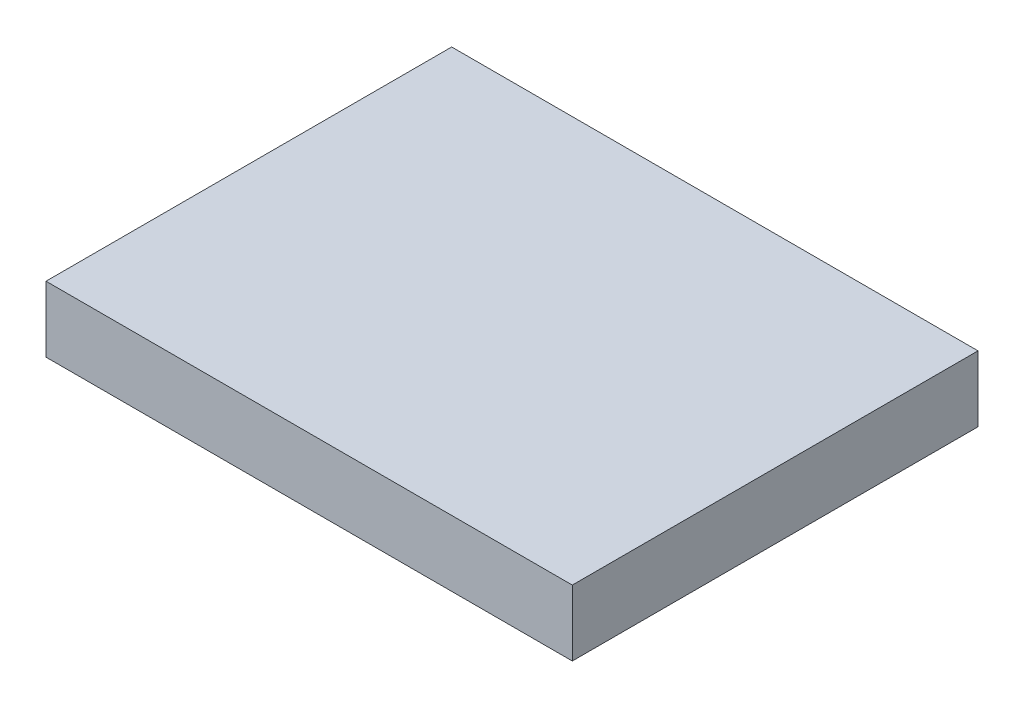
ISO-10303-21;
HEADER;
FILE_DESCRIPTION(('STEP AP214'),'2;1');
FILE_NAME('part.step','',(''),(''),'','','');
FILE_SCHEMA(('AUTOMOTIVE_DESIGN { 1 0 10303 214 1 1 1 1 }'));
ENDSEC;
DATA;
#1=APPLICATION_CONTEXT('core data for automotive mechanical design processes');
#2=APPLICATION_PROTOCOL_DEFINITION('international standard','automotive_design',2000,#1);
#3=PRODUCT_CONTEXT('',#1,'mechanical');
#4=PRODUCT('Part','Part','',(#3));
#5=PRODUCT_RELATED_PRODUCT_CATEGORY('part','',(#4));
#6=PRODUCT_DEFINITION_FORMATION('','',#4);
#7=PRODUCT_DEFINITION_CONTEXT('part definition',#1,'design');
#8=PRODUCT_DEFINITION('design','',#6,#7);
#9=PRODUCT_DEFINITION_SHAPE('','',#8);
#10=(LENGTH_UNIT() NAMED_UNIT(*) SI_UNIT(.MILLI.,.METRE.));
#11=(NAMED_UNIT(*) PLANE_ANGLE_UNIT() SI_UNIT($,.RADIAN.));
#12=(NAMED_UNIT(*) SI_UNIT($,.STERADIAN.) SOLID_ANGLE_UNIT());
#13=UNCERTAINTY_MEASURE_WITH_UNIT(LENGTH_MEASURE(1.E-05),#10,'distance_accuracy_value','');
#14=(GEOMETRIC_REPRESENTATION_CONTEXT(3) GLOBAL_UNCERTAINTY_ASSIGNED_CONTEXT((#13)) GLOBAL_UNIT_ASSIGNED_CONTEXT((#10,
#11,#12)) REPRESENTATION_CONTEXT('',''));
#15=CARTESIAN_POINT('',(0.,0.,0.));
#16=DIRECTION('',(0.,0.,1.));
#17=DIRECTION('',(1.,0.,0.));
#18=AXIS2_PLACEMENT_3D('',#15,#16,#17);
#19=CARTESIAN_POINT('',(120.,30.,92.5));
#20=DIRECTION('',(-1.,0.,0.));
#21=DIRECTION('',(0.,0.,1.));
#22=AXIS2_PLACEMENT_3D('',#19,#20,#21);
#23=PLANE('',#22);
#24=DIRECTION('',(0.,0.,-1.));
#25=VECTOR('',#24,1.);
#26=CARTESIAN_POINT('',(120.,0.,92.5));
#27=LINE('',#26,#25);
#28=CARTESIAN_POINT('',(120.,0.,92.5));
#29=VERTEX_POINT('',#28);
#30=CARTESIAN_POINT('',(120.,0.,-92.5));
#31=VERTEX_POINT('',#30);
#32=EDGE_CURVE('E113',#29,#31,#27,.T.);
#33=ORIENTED_EDGE('',*,*,#32,.T.);
#34=DIRECTION('',(0.,-1.,0.));
#35=VECTOR('',#34,1.);
#36=CARTESIAN_POINT('',(120.,30.,-92.5));
#37=LINE('',#36,#35);
#38=CARTESIAN_POINT('',(120.,30.,-92.5));
#39=VERTEX_POINT('',#38);
#40=EDGE_CURVE('E11',#39,#31,#37,.T.);
#41=ORIENTED_EDGE('',*,*,#40,.F.);
#42=DIRECTION('',(0.,0.,-1.));
#43=VECTOR('',#42,1.);
#44=CARTESIAN_POINT('',(120.,30.,92.5));
#45=LINE('',#44,#43);
#46=CARTESIAN_POINT('',(120.,30.,92.5));
#47=VERTEX_POINT('',#46);
#48=EDGE_CURVE('E97',#47,#39,#45,.T.);
#49=ORIENTED_EDGE('',*,*,#48,.F.);
#50=DIRECTION('',(0.,-1.,0.));
#51=VECTOR('',#50,1.);
#52=CARTESIAN_POINT('',(120.,30.,92.5));
#53=LINE('',#52,#51);
#54=EDGE_CURVE('E109',#47,#29,#53,.T.);
#55=ORIENTED_EDGE('',*,*,#54,.T.);
#56=EDGE_LOOP('',(#33,#41,#49,#55));
#57=FACE_BOUND('',#56,.T.);
#58=ADVANCED_FACE('F45',(#57),#23,.F.);
#59=CARTESIAN_POINT('',(-120.,30.,-92.5));
#60=DIRECTION('',(0.,0.,1.));
#61=DIRECTION('',(1.,0.,0.));
#62=AXIS2_PLACEMENT_3D('',#59,#60,#61);
#63=PLANE('',#62);
#64=DIRECTION('',(-1.,0.,0.));
#65=VECTOR('',#64,1.);
#66=CARTESIAN_POINT('',(-120.,0.,-92.5));
#67=LINE('',#66,#65);
#68=CARTESIAN_POINT('',(-120.,0.,-92.5));
#69=VERTEX_POINT('',#68);
#70=EDGE_CURVE('E102',#31,#69,#67,.T.);
#71=ORIENTED_EDGE('',*,*,#70,.T.);
#72=DIRECTION('',(0.,-1.,0.));
#73=VECTOR('',#72,1.);
#74=CARTESIAN_POINT('',(-120.,30.,-92.5));
#75=LINE('',#74,#73);
#76=CARTESIAN_POINT('',(-120.,30.,-92.5));
#77=VERTEX_POINT('',#76);
#78=EDGE_CURVE('E54',#77,#69,#75,.T.);
#79=ORIENTED_EDGE('',*,*,#78,.F.);
#80=DIRECTION('',(-1.,0.,0.));
#81=VECTOR('',#80,1.);
#82=CARTESIAN_POINT('',(-120.,30.,-92.5));
#83=LINE('',#82,#81);
#84=EDGE_CURVE('E92',#39,#77,#83,.T.);
#85=ORIENTED_EDGE('',*,*,#84,.F.);
#86=ORIENTED_EDGE('',*,*,#40,.T.);
#87=EDGE_LOOP('',(#71,#79,#85,#86));
#88=FACE_BOUND('',#87,.T.);
#89=ADVANCED_FACE('F101',(#88),#63,.F.);
#90=CARTESIAN_POINT('',(-120.,30.,92.5));
#91=DIRECTION('',(1.,0.,0.));
#92=DIRECTION('',(0.,0.,-1.));
#93=AXIS2_PLACEMENT_3D('',#90,#91,#92);
#94=PLANE('',#93);
#95=DIRECTION('',(0.,0.,1.));
#96=VECTOR('',#95,1.);
#97=CARTESIAN_POINT('',(-120.,0.,92.5));
#98=LINE('',#97,#96);
#99=CARTESIAN_POINT('',(-120.,0.,92.5));
#100=VERTEX_POINT('',#99);
#101=EDGE_CURVE('E79',#69,#100,#98,.T.);
#102=ORIENTED_EDGE('',*,*,#101,.T.);
#103=DIRECTION('',(0.,-1.,0.));
#104=VECTOR('',#103,1.);
#105=CARTESIAN_POINT('',(-120.,30.,92.5));
#106=LINE('',#105,#104);
#107=CARTESIAN_POINT('',(-120.,30.,92.5));
#108=VERTEX_POINT('',#107);
#109=EDGE_CURVE('E104',#108,#100,#106,.T.);
#110=ORIENTED_EDGE('',*,*,#109,.F.);
#111=DIRECTION('',(0.,0.,1.));
#112=VECTOR('',#111,1.);
#113=CARTESIAN_POINT('',(-120.,30.,92.5));
#114=LINE('',#113,#112);
#115=EDGE_CURVE('E95',#77,#108,#114,.T.);
#116=ORIENTED_EDGE('',*,*,#115,.F.);
#117=ORIENTED_EDGE('',*,*,#78,.T.);
#118=EDGE_LOOP('',(#102,#110,#116,#117));
#119=FACE_BOUND('',#118,.T.);
#120=ADVANCED_FACE('F105',(#119),#94,.F.);
#121=CARTESIAN_POINT('',(-120.,30.,92.5));
#122=DIRECTION('',(0.,0.,-1.));
#123=DIRECTION('',(-1.,0.,0.));
#124=AXIS2_PLACEMENT_3D('',#121,#122,#123);
#125=PLANE('',#124);
#126=DIRECTION('',(1.,0.,0.));
#127=VECTOR('',#126,1.);
#128=CARTESIAN_POINT('',(-120.,0.,92.5));
#129=LINE('',#128,#127);
#130=EDGE_CURVE('E85',#100,#29,#129,.T.);
#131=ORIENTED_EDGE('',*,*,#130,.T.);
#132=ORIENTED_EDGE('',*,*,#54,.F.);
#133=DIRECTION('',(1.,0.,0.));
#134=VECTOR('',#133,1.);
#135=CARTESIAN_POINT('',(-120.,30.,92.5));
#136=LINE('',#135,#134);
#137=EDGE_CURVE('E62',#108,#47,#136,.T.);
#138=ORIENTED_EDGE('',*,*,#137,.F.);
#139=ORIENTED_EDGE('',*,*,#109,.T.);
#140=EDGE_LOOP('',(#131,#132,#138,#139));
#141=FACE_BOUND('',#140,.T.);
#142=ADVANCED_FACE('F126',(#141),#125,.F.);
#143=CARTESIAN_POINT('',(0.,30.,0.));
#144=DIRECTION('',(0.,-1.,0.));
#145=DIRECTION('',(0.,0.,-1.));
#146=AXIS2_PLACEMENT_3D('',#143,#144,#145);
#147=PLANE('',#146);
#148=ORIENTED_EDGE('',*,*,#48,.T.);
#149=ORIENTED_EDGE('',*,*,#84,.T.);
#150=ORIENTED_EDGE('',*,*,#115,.T.);
#151=ORIENTED_EDGE('',*,*,#137,.T.);
#152=EDGE_LOOP('',(#148,#149,#150,#151));
#153=FACE_BOUND('',#152,.T.);
#154=ADVANCED_FACE('F93',(#153),#147,.F.);
#155=CARTESIAN_POINT('',(0.,0.,0.));
#156=DIRECTION('',(0.,-1.,0.));
#157=DIRECTION('',(0.,0.,-1.));
#158=AXIS2_PLACEMENT_3D('',#155,#156,#157);
#159=PLANE('',#158);
#160=ORIENTED_EDGE('',*,*,#32,.F.);
#161=ORIENTED_EDGE('',*,*,#130,.F.);
#162=ORIENTED_EDGE('',*,*,#101,.F.);
#163=ORIENTED_EDGE('',*,*,#70,.F.);
#164=EDGE_LOOP('',(#160,#161,#162,#163));
#165=FACE_BOUND('',#164,.T.);
#166=ADVANCED_FACE('F129',(#165),#159,.T.);
#167=CLOSED_SHELL('',(#58,#89,#120,#142,#154,#166));
#168=MANIFOLD_SOLID_BREP('B2',#167);
#169=ADVANCED_BREP_SHAPE_REPRESENTATION('',(#18,#168),#14);
#170=SHAPE_DEFINITION_REPRESENTATION(#9,#169);
ENDSEC;
END-ISO-10303-21;
